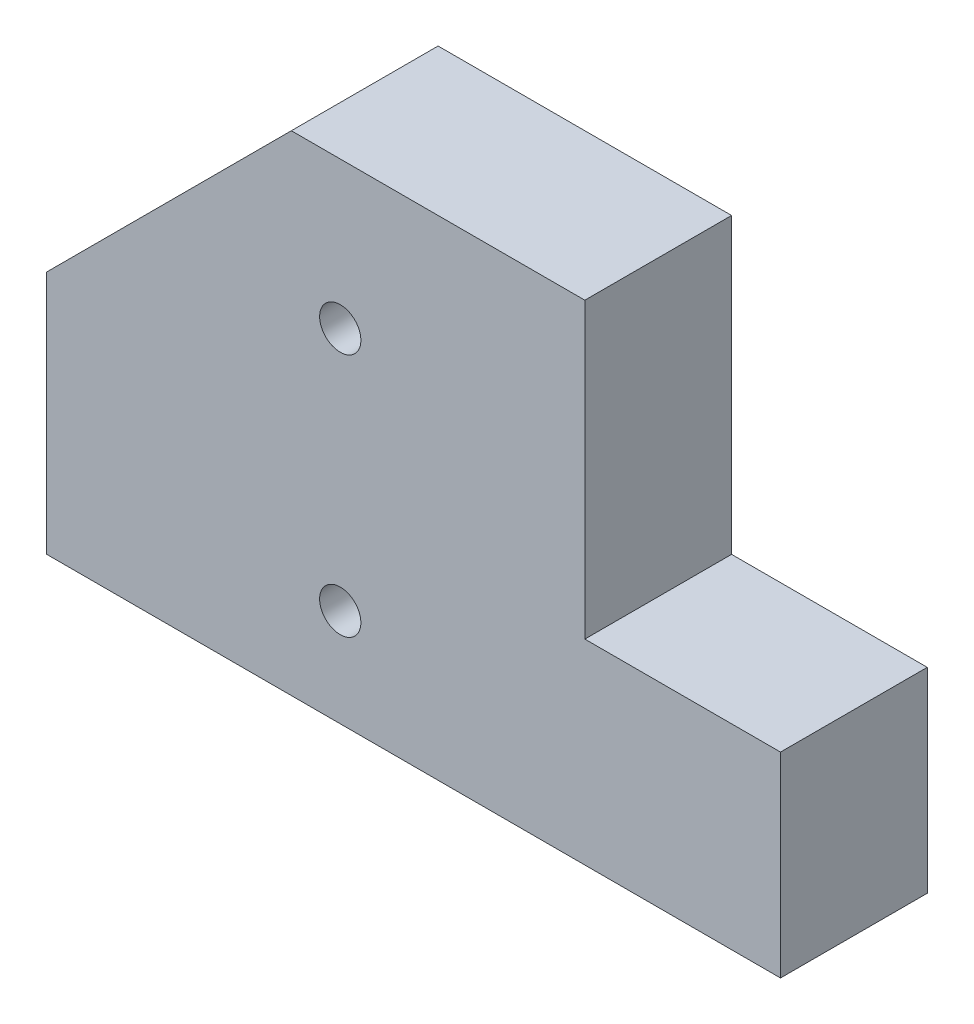
ISO-10303-21;
HEADER;
FILE_DESCRIPTION(('STEP AP214'),'2;1');
FILE_NAME('part.step','',(''),(''),'','','');
FILE_SCHEMA(('AUTOMOTIVE_DESIGN { 1 0 10303 214 1 1 1 1 }'));
ENDSEC;
DATA;
#1=APPLICATION_CONTEXT('core data for automotive mechanical design processes');
#2=APPLICATION_PROTOCOL_DEFINITION('international standard','automotive_design',2000,#1);
#3=PRODUCT_CONTEXT('',#1,'mechanical');
#4=PRODUCT('Part','Part','',(#3));
#5=PRODUCT_RELATED_PRODUCT_CATEGORY('part','',(#4));
#6=PRODUCT_DEFINITION_FORMATION('','',#4);
#7=PRODUCT_DEFINITION_CONTEXT('part definition',#1,'design');
#8=PRODUCT_DEFINITION('design','',#6,#7);
#9=PRODUCT_DEFINITION_SHAPE('','',#8);
#10=(LENGTH_UNIT() NAMED_UNIT(*) SI_UNIT(.MILLI.,.METRE.));
#11=(NAMED_UNIT(*) PLANE_ANGLE_UNIT() SI_UNIT($,.RADIAN.));
#12=(NAMED_UNIT(*) SI_UNIT($,.STERADIAN.) SOLID_ANGLE_UNIT());
#13=UNCERTAINTY_MEASURE_WITH_UNIT(LENGTH_MEASURE(1.E-05),#10,'distance_accuracy_value','');
#14=(GEOMETRIC_REPRESENTATION_CONTEXT(3) GLOBAL_UNCERTAINTY_ASSIGNED_CONTEXT((#13)) GLOBAL_UNIT_ASSIGNED_CONTEXT((#10,
#11,#12)) REPRESENTATION_CONTEXT('',''));
#15=CARTESIAN_POINT('',(0.,0.,0.));
#16=DIRECTION('',(0.,0.,1.));
#17=DIRECTION('',(1.,0.,0.));
#18=AXIS2_PLACEMENT_3D('',#15,#16,#17);
#19=CARTESIAN_POINT('',(150.,0.,30.));
#20=DIRECTION('',(0.,1.,0.));
#21=DIRECTION('',(-1.,0.,0.));
#22=AXIS2_PLACEMENT_3D('',#19,#20,#21);
#23=PLANE('',#22);
#24=DIRECTION('',(1.,0.,0.));
#25=VECTOR('',#24,1.);
#26=CARTESIAN_POINT('',(150.,0.,0.));
#27=LINE('',#26,#25);
#28=CARTESIAN_POINT('',(0.,0.,0.));
#29=VERTEX_POINT('',#28);
#30=CARTESIAN_POINT('',(150.,0.,0.));
#31=VERTEX_POINT('',#30);
#32=EDGE_CURVE('E125',#29,#31,#27,.T.);
#33=ORIENTED_EDGE('',*,*,#32,.T.);
#34=DIRECTION('',(0.,0.,-1.));
#35=VECTOR('',#34,1.);
#36=CARTESIAN_POINT('',(150.,0.,30.));
#37=LINE('',#36,#35);
#38=CARTESIAN_POINT('',(150.,0.,30.));
#39=VERTEX_POINT('',#38);
#40=EDGE_CURVE('E11',#39,#31,#37,.T.);
#41=ORIENTED_EDGE('',*,*,#40,.F.);
#42=DIRECTION('',(1.,0.,0.));
#43=VECTOR('',#42,1.);
#44=CARTESIAN_POINT('',(150.,0.,30.));
#45=LINE('',#44,#43);
#46=CARTESIAN_POINT('',(0.,0.,30.));
#47=VERTEX_POINT('',#46);
#48=EDGE_CURVE('E138',#47,#39,#45,.T.);
#49=ORIENTED_EDGE('',*,*,#48,.F.);
#50=DIRECTION('',(0.,0.,-1.));
#51=VECTOR('',#50,1.);
#52=CARTESIAN_POINT('',(0.,0.,30.));
#53=LINE('',#52,#51);
#54=EDGE_CURVE('E121',#47,#29,#53,.T.);
#55=ORIENTED_EDGE('',*,*,#54,.T.);
#56=EDGE_LOOP('',(#33,#41,#49,#55));
#57=FACE_BOUND('',#56,.T.);
#58=ADVANCED_FACE('F32',(#57),#23,.F.);
#59=CARTESIAN_POINT('',(150.,40.,30.));
#60=DIRECTION('',(-1.,0.,0.));
#61=DIRECTION('',(0.,0.,1.));
#62=AXIS2_PLACEMENT_3D('',#59,#60,#61);
#63=PLANE('',#62);
#64=DIRECTION('',(0.,1.,0.));
#65=VECTOR('',#64,1.);
#66=CARTESIAN_POINT('',(150.,40.,0.));
#67=LINE('',#66,#65);
#68=CARTESIAN_POINT('',(150.,40.,0.));
#69=VERTEX_POINT('',#68);
#70=EDGE_CURVE('E128',#31,#69,#67,.T.);
#71=ORIENTED_EDGE('',*,*,#70,.T.);
#72=DIRECTION('',(0.,0.,-1.));
#73=VECTOR('',#72,1.);
#74=CARTESIAN_POINT('',(150.,40.,30.));
#75=LINE('',#74,#73);
#76=CARTESIAN_POINT('',(150.,40.,30.));
#77=VERTEX_POINT('',#76);
#78=EDGE_CURVE('E40',#77,#69,#75,.T.);
#79=ORIENTED_EDGE('',*,*,#78,.F.);
#80=DIRECTION('',(0.,1.,0.));
#81=VECTOR('',#80,1.);
#82=CARTESIAN_POINT('',(150.,40.,30.));
#83=LINE('',#82,#81);
#84=EDGE_CURVE('E89',#39,#77,#83,.T.);
#85=ORIENTED_EDGE('',*,*,#84,.F.);
#86=ORIENTED_EDGE('',*,*,#40,.T.);
#87=EDGE_LOOP('',(#71,#79,#85,#86));
#88=FACE_BOUND('',#87,.T.);
#89=ADVANCED_FACE('F197',(#88),#63,.F.);
#90=CARTESIAN_POINT('',(110.,40.,30.));
#91=DIRECTION('',(0.,-1.,0.));
#92=DIRECTION('',(0.,0.,-1.));
#93=AXIS2_PLACEMENT_3D('',#90,#91,#92);
#94=PLANE('',#93);
#95=DIRECTION('',(-1.,0.,0.));
#96=VECTOR('',#95,1.);
#97=CARTESIAN_POINT('',(110.,40.,0.));
#98=LINE('',#97,#96);
#99=CARTESIAN_POINT('',(110.,40.,0.));
#100=VERTEX_POINT('',#99);
#101=EDGE_CURVE('E131',#69,#100,#98,.T.);
#102=ORIENTED_EDGE('',*,*,#101,.T.);
#103=DIRECTION('',(0.,0.,-1.));
#104=VECTOR('',#103,1.);
#105=CARTESIAN_POINT('',(110.,40.,30.));
#106=LINE('',#105,#104);
#107=CARTESIAN_POINT('',(110.,40.,30.));
#108=VERTEX_POINT('',#107);
#109=EDGE_CURVE('E142',#108,#100,#106,.T.);
#110=ORIENTED_EDGE('',*,*,#109,.F.);
#111=DIRECTION('',(-1.,0.,0.));
#112=VECTOR('',#111,1.);
#113=CARTESIAN_POINT('',(110.,40.,30.));
#114=LINE('',#113,#112);
#115=EDGE_CURVE('E150',#77,#108,#114,.T.);
#116=ORIENTED_EDGE('',*,*,#115,.F.);
#117=ORIENTED_EDGE('',*,*,#78,.T.);
#118=EDGE_LOOP('',(#102,#110,#116,#117));
#119=FACE_BOUND('',#118,.T.);
#120=ADVANCED_FACE('F148',(#119),#94,.F.);
#121=CARTESIAN_POINT('',(110.,100.,30.));
#122=DIRECTION('',(-1.,0.,0.));
#123=DIRECTION('',(0.,-1.,0.));
#124=AXIS2_PLACEMENT_3D('',#121,#122,#123);
#125=PLANE('',#124);
#126=DIRECTION('',(0.,1.,0.));
#127=VECTOR('',#126,1.);
#128=CARTESIAN_POINT('',(110.,100.,0.));
#129=LINE('',#128,#127);
#130=CARTESIAN_POINT('',(110.,100.,0.));
#131=VERTEX_POINT('',#130);
#132=EDGE_CURVE('E133',#100,#131,#129,.T.);
#133=ORIENTED_EDGE('',*,*,#132,.T.);
#134=DIRECTION('',(0.,0.,-1.));
#135=VECTOR('',#134,1.);
#136=CARTESIAN_POINT('',(110.,100.,30.));
#137=LINE('',#136,#135);
#138=CARTESIAN_POINT('',(110.,100.,30.));
#139=VERTEX_POINT('',#138);
#140=EDGE_CURVE('E116',#139,#131,#137,.T.);
#141=ORIENTED_EDGE('',*,*,#140,.F.);
#142=DIRECTION('',(0.,1.,0.));
#143=VECTOR('',#142,1.);
#144=CARTESIAN_POINT('',(110.,100.,30.));
#145=LINE('',#144,#143);
#146=EDGE_CURVE('E107',#108,#139,#145,.T.);
#147=ORIENTED_EDGE('',*,*,#146,.F.);
#148=ORIENTED_EDGE('',*,*,#109,.T.);
#149=EDGE_LOOP('',(#133,#141,#147,#148));
#150=FACE_BOUND('',#149,.T.);
#151=ADVANCED_FACE('F156',(#150),#125,.F.);
#152=CARTESIAN_POINT('',(50.0000000000001,100.,30.));
#153=DIRECTION('',(0.,-1.,0.));
#154=DIRECTION('',(1.,0.,0.));
#155=AXIS2_PLACEMENT_3D('',#152,#153,#154);
#156=PLANE('',#155);
#157=DIRECTION('',(-1.,0.,0.));
#158=VECTOR('',#157,1.);
#159=CARTESIAN_POINT('',(50.0000000000001,100.,0.));
#160=LINE('',#159,#158);
#161=CARTESIAN_POINT('',(50.0000000000001,100.,0.));
#162=VERTEX_POINT('',#161);
#163=EDGE_CURVE('E115',#131,#162,#160,.T.);
#164=ORIENTED_EDGE('',*,*,#163,.T.);
#165=DIRECTION('',(0.,0.,-1.));
#166=VECTOR('',#165,1.);
#167=CARTESIAN_POINT('',(50.0000000000001,100.,30.));
#168=LINE('',#167,#166);
#169=CARTESIAN_POINT('',(50.0000000000001,100.,30.));
#170=VERTEX_POINT('',#169);
#171=EDGE_CURVE('E112',#170,#162,#168,.T.);
#172=ORIENTED_EDGE('',*,*,#171,.F.);
#173=DIRECTION('',(-1.,0.,0.));
#174=VECTOR('',#173,1.);
#175=CARTESIAN_POINT('',(50.0000000000001,100.,30.));
#176=LINE('',#175,#174);
#177=EDGE_CURVE('E101',#139,#170,#176,.T.);
#178=ORIENTED_EDGE('',*,*,#177,.F.);
#179=ORIENTED_EDGE('',*,*,#140,.T.);
#180=EDGE_LOOP('',(#164,#172,#178,#179));
#181=FACE_BOUND('',#180,.T.);
#182=ADVANCED_FACE('F113',(#181),#156,.F.);
#183=CARTESIAN_POINT('',(0.,50.,30.));
#184=DIRECTION('',(0.707106781186546,-0.707106781186549,0.));
#185=DIRECTION('',(0.707106781186549,0.707106781186546,0.));
#186=AXIS2_PLACEMENT_3D('',#183,#184,#185);
#187=PLANE('',#186);
#188=DIRECTION('',(-0.707106781186549,-0.707106781186546,0.));
#189=VECTOR('',#188,1.);
#190=CARTESIAN_POINT('',(0.,50.,0.));
#191=LINE('',#190,#189);
#192=CARTESIAN_POINT('',(0.,50.,0.));
#193=VERTEX_POINT('',#192);
#194=EDGE_CURVE('E75',#162,#193,#191,.T.);
#195=ORIENTED_EDGE('',*,*,#194,.T.);
#196=DIRECTION('',(0.,0.,-1.));
#197=VECTOR('',#196,1.);
#198=CARTESIAN_POINT('',(0.,50.,30.));
#199=LINE('',#198,#197);
#200=CARTESIAN_POINT('',(0.,50.,30.));
#201=VERTEX_POINT('',#200);
#202=EDGE_CURVE('E117',#201,#193,#199,.T.);
#203=ORIENTED_EDGE('',*,*,#202,.F.);
#204=DIRECTION('',(-0.707106781186549,-0.707106781186546,0.));
#205=VECTOR('',#204,1.);
#206=CARTESIAN_POINT('',(0.,50.,30.));
#207=LINE('',#206,#205);
#208=EDGE_CURVE('E105',#170,#201,#207,.T.);
#209=ORIENTED_EDGE('',*,*,#208,.F.);
#210=ORIENTED_EDGE('',*,*,#171,.T.);
#211=EDGE_LOOP('',(#195,#203,#209,#210));
#212=FACE_BOUND('',#211,.T.);
#213=ADVANCED_FACE('F119',(#212),#187,.F.);
#214=CARTESIAN_POINT('',(0.,0.,30.));
#215=DIRECTION('',(1.,0.,0.));
#216=DIRECTION('',(0.,0.,-1.));
#217=AXIS2_PLACEMENT_3D('',#214,#215,#216);
#218=PLANE('',#217);
#219=DIRECTION('',(0.,-1.,0.));
#220=VECTOR('',#219,1.);
#221=CARTESIAN_POINT('',(0.,0.,0.));
#222=LINE('',#221,#220);
#223=EDGE_CURVE('E81',#193,#29,#222,.T.);
#224=ORIENTED_EDGE('',*,*,#223,.T.);
#225=ORIENTED_EDGE('',*,*,#54,.F.);
#226=DIRECTION('',(0.,-1.,0.));
#227=VECTOR('',#226,1.);
#228=CARTESIAN_POINT('',(0.,0.,30.));
#229=LINE('',#228,#227);
#230=EDGE_CURVE('E48',#201,#47,#229,.T.);
#231=ORIENTED_EDGE('',*,*,#230,.F.);
#232=ORIENTED_EDGE('',*,*,#202,.T.);
#233=EDGE_LOOP('',(#224,#225,#231,#232));
#234=FACE_BOUND('',#233,.T.);
#235=ADVANCED_FACE('F177',(#234),#218,.F.);
#236=CARTESIAN_POINT('',(0.,0.,30.));
#237=DIRECTION('',(0.,0.,-1.));
#238=DIRECTION('',(-1.,0.,0.));
#239=AXIS2_PLACEMENT_3D('',#236,#237,#238);
#240=PLANE('',#239);
#241=CARTESIAN_POINT('',(60.0000000000001,70.,30.));
#242=DIRECTION('',(0.,0.,1.));
#243=DIRECTION('',(1.,0.,0.));
#244=AXIS2_PLACEMENT_3D('',#241,#242,#243);
#245=CIRCLE('',#244,4.21639999999999);
#246=CARTESIAN_POINT('',(64.2164000000001,70.,30.));
#247=VERTEX_POINT('',#246);
#248=EDGE_CURVE('E169',#247,#247,#245,.T.);
#249=ORIENTED_EDGE('',*,*,#248,.F.);
#250=EDGE_LOOP('',(#249));
#251=FACE_BOUND('',#250,.T.);
#252=CARTESIAN_POINT('',(60.0000000000002,20.,30.));
#253=DIRECTION('',(0.,0.,1.));
#254=DIRECTION('',(1.,0.,0.));
#255=AXIS2_PLACEMENT_3D('',#252,#253,#254);
#256=CIRCLE('',#255,4.21639999999999);
#257=CARTESIAN_POINT('',(64.2164000000002,20.,30.));
#258=VERTEX_POINT('',#257);
#259=EDGE_CURVE('E163',#258,#258,#256,.T.);
#260=ORIENTED_EDGE('',*,*,#259,.F.);
#261=EDGE_LOOP('',(#260));
#262=FACE_BOUND('',#261,.T.);
#263=ORIENTED_EDGE('',*,*,#48,.T.);
#264=ORIENTED_EDGE('',*,*,#84,.T.);
#265=ORIENTED_EDGE('',*,*,#115,.T.);
#266=ORIENTED_EDGE('',*,*,#146,.T.);
#267=ORIENTED_EDGE('',*,*,#177,.T.);
#268=ORIENTED_EDGE('',*,*,#208,.T.);
#269=ORIENTED_EDGE('',*,*,#230,.T.);
#270=EDGE_LOOP('',(#263,#264,#265,#266,#267,#268,#269));
#271=FACE_BOUND('',#270,.T.);
#272=ADVANCED_FACE('F103',(#251,#262,#271),#240,.F.);
#273=CARTESIAN_POINT('',(0.,0.,0.));
#274=DIRECTION('',(0.,0.,-1.));
#275=DIRECTION('',(-1.,0.,0.));
#276=AXIS2_PLACEMENT_3D('',#273,#274,#275);
#277=PLANE('',#276);
#278=ORIENTED_EDGE('',*,*,#32,.F.);
#279=ORIENTED_EDGE('',*,*,#223,.F.);
#280=ORIENTED_EDGE('',*,*,#194,.F.);
#281=ORIENTED_EDGE('',*,*,#163,.F.);
#282=ORIENTED_EDGE('',*,*,#132,.F.);
#283=ORIENTED_EDGE('',*,*,#101,.F.);
#284=ORIENTED_EDGE('',*,*,#70,.F.);
#285=EDGE_LOOP('',(#278,#279,#280,#281,#282,#283,#284));
#286=FACE_BOUND('',#285,.T.);
#287=ADVANCED_FACE('F154',(#286),#277,.T.);
#288=CARTESIAN_POINT('',(60.0000000000002,20.,4.6));
#289=DIRECTION('',(0.,0.,1.));
#290=DIRECTION('',(1.,0.,0.));
#291=AXIS2_PLACEMENT_3D('',#288,#289,#290);
#292=CONICAL_SURFACE('',#291,4.21639999999999,1.02974425867665);
#293=CARTESIAN_POINT('',(60.0000000000002,20.,2.06653128593219));
#294=VERTEX_POINT('',#293);
#295=VERTEX_LOOP('',#294);
#296=FACE_BOUND('',#295,.T.);
#297=CARTESIAN_POINT('',(60.0000000000002,20.,4.6));
#298=DIRECTION('',(0.,0.,1.));
#299=DIRECTION('',(1.,0.,0.));
#300=AXIS2_PLACEMENT_3D('',#297,#298,#299);
#301=CIRCLE('',#300,4.21639999999999);
#302=CARTESIAN_POINT('',(64.2164000000002,20.,4.6));
#303=VERTEX_POINT('',#302);
#304=EDGE_CURVE('E129',#303,#303,#301,.T.);
#305=ORIENTED_EDGE('',*,*,#304,.T.);
#306=EDGE_LOOP('',(#305));
#307=FACE_BOUND('',#306,.T.);
#308=ADVANCED_FACE('F184',(#296,#307),#292,.F.);
#309=CARTESIAN_POINT('',(60.0000000000002,20.,30.));
#310=DIRECTION('',(0.,0.,1.));
#311=DIRECTION('',(1.,0.,0.));
#312=AXIS2_PLACEMENT_3D('',#309,#310,#311);
#313=CYLINDRICAL_SURFACE('',#312,4.21639999999999);
#314=ORIENTED_EDGE('',*,*,#304,.F.);
#315=EDGE_LOOP('',(#314));
#316=FACE_BOUND('',#315,.T.);
#317=ORIENTED_EDGE('',*,*,#259,.T.);
#318=EDGE_LOOP('',(#317));
#319=FACE_BOUND('',#318,.T.);
#320=ADVANCED_FACE('F181',(#316,#319),#313,.F.);
#321=CARTESIAN_POINT('',(60.0000000000001,70.,4.6));
#322=DIRECTION('',(0.,0.,1.));
#323=DIRECTION('',(1.,0.,0.));
#324=AXIS2_PLACEMENT_3D('',#321,#322,#323);
#325=CONICAL_SURFACE('',#324,4.21639999999999,1.02974425867665);
#326=CARTESIAN_POINT('',(60.0000000000001,70.,2.06653128593219));
#327=VERTEX_POINT('',#326);
#328=VERTEX_LOOP('',#327);
#329=FACE_BOUND('',#328,.T.);
#330=CARTESIAN_POINT('',(60.0000000000001,70.,4.6));
#331=DIRECTION('',(0.,0.,1.));
#332=DIRECTION('',(1.,0.,0.));
#333=AXIS2_PLACEMENT_3D('',#330,#331,#332);
#334=CIRCLE('',#333,4.21639999999999);
#335=CARTESIAN_POINT('',(64.2164000000001,70.,4.6));
#336=VERTEX_POINT('',#335);
#337=EDGE_CURVE('E166',#336,#336,#334,.T.);
#338=ORIENTED_EDGE('',*,*,#337,.T.);
#339=EDGE_LOOP('',(#338));
#340=FACE_BOUND('',#339,.T.);
#341=ADVANCED_FACE('F183',(#329,#340),#325,.F.);
#342=CARTESIAN_POINT('',(60.0000000000001,70.,30.));
#343=DIRECTION('',(0.,0.,1.));
#344=DIRECTION('',(1.,0.,0.));
#345=AXIS2_PLACEMENT_3D('',#342,#343,#344);
#346=CYLINDRICAL_SURFACE('',#345,4.21639999999999);
#347=ORIENTED_EDGE('',*,*,#337,.F.);
#348=EDGE_LOOP('',(#347));
#349=FACE_BOUND('',#348,.T.);
#350=ORIENTED_EDGE('',*,*,#248,.T.);
#351=EDGE_LOOP('',(#350));
#352=FACE_BOUND('',#351,.T.);
#353=ADVANCED_FACE('F173',(#349,#352),#346,.F.);
#354=CLOSED_SHELL('',(#58,#89,#120,#151,#182,#213,#235,#272,#287,#308,#320,#341,#353));
#355=MANIFOLD_SOLID_BREP('B2',#354);
#356=ADVANCED_BREP_SHAPE_REPRESENTATION('',(#18,#355),#14);
#357=SHAPE_DEFINITION_REPRESENTATION(#9,#356);
ENDSEC;
END-ISO-10303-21;
